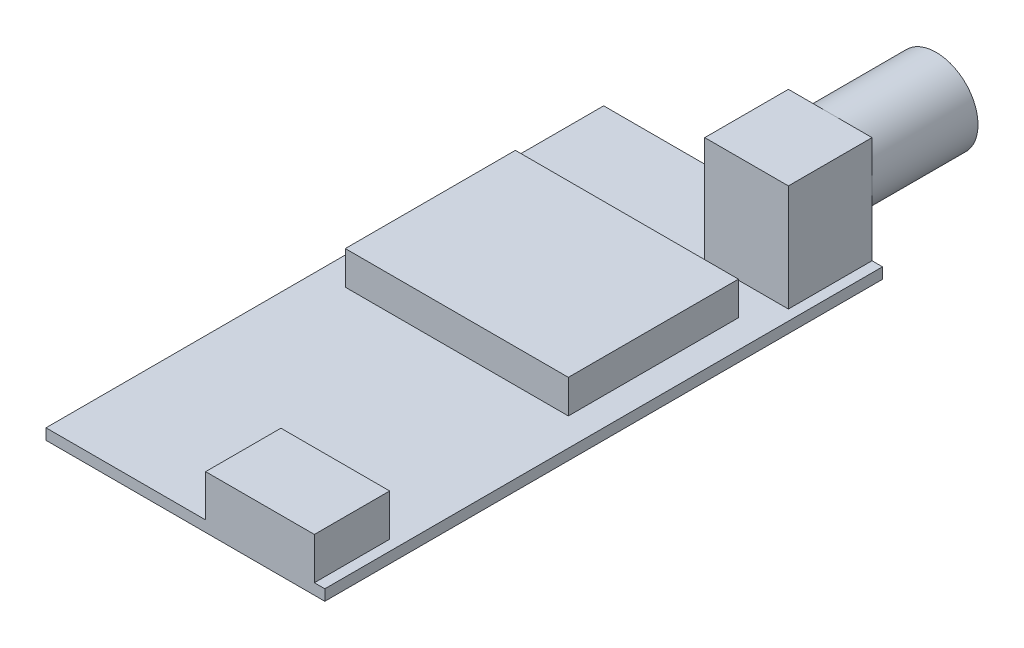
ISO-10303-21;
HEADER;
FILE_DESCRIPTION(('STEP AP214'),'2;1');
FILE_NAME('part.step','',(''),(''),'','','');
FILE_SCHEMA(('AUTOMOTIVE_DESIGN { 1 0 10303 214 1 1 1 1 }'));
ENDSEC;
DATA;
#1=APPLICATION_CONTEXT('core data for automotive mechanical design processes');
#2=APPLICATION_PROTOCOL_DEFINITION('international standard','automotive_design',2000,#1);
#3=PRODUCT_CONTEXT('',#1,'mechanical');
#4=PRODUCT('Part','Part','',(#3));
#5=PRODUCT_RELATED_PRODUCT_CATEGORY('part','',(#4));
#6=PRODUCT_DEFINITION_FORMATION('','',#4);
#7=PRODUCT_DEFINITION_CONTEXT('part definition',#1,'design');
#8=PRODUCT_DEFINITION('design','',#6,#7);
#9=PRODUCT_DEFINITION_SHAPE('','',#8);
#10=(LENGTH_UNIT() NAMED_UNIT(*) SI_UNIT(.MILLI.,.METRE.));
#11=(NAMED_UNIT(*) PLANE_ANGLE_UNIT() SI_UNIT($,.RADIAN.));
#12=(NAMED_UNIT(*) SI_UNIT($,.STERADIAN.) SOLID_ANGLE_UNIT());
#13=UNCERTAINTY_MEASURE_WITH_UNIT(LENGTH_MEASURE(1.E-05),#10,'distance_accuracy_value','');
#14=(GEOMETRIC_REPRESENTATION_CONTEXT(3) GLOBAL_UNCERTAINTY_ASSIGNED_CONTEXT((#13)) GLOBAL_UNIT_ASSIGNED_CONTEXT((#10,
#11,#12)) REPRESENTATION_CONTEXT('',''));
#15=CARTESIAN_POINT('',(0.,0.,0.));
#16=DIRECTION('',(0.,0.,1.));
#17=DIRECTION('',(1.,0.,0.));
#18=AXIS2_PLACEMENT_3D('',#15,#16,#17);
#19=CARTESIAN_POINT('',(0.,0.78,0.));
#20=DIRECTION('',(0.,-1.,0.));
#21=DIRECTION('',(0.,0.,-1.));
#22=AXIS2_PLACEMENT_3D('',#19,#20,#21);
#23=PLANE('',#22);
#24=DIRECTION('',(0.,0.,1.));
#25=VECTOR('',#24,1.);
#26=CARTESIAN_POINT('',(1.45,0.78,40.));
#27=LINE('',#26,#25);
#28=CARTESIAN_POINT('',(1.45,0.78,34.6));
#29=VERTEX_POINT('',#28);
#30=CARTESIAN_POINT('',(1.45,0.78,40.));
#31=VERTEX_POINT('',#30);
#32=EDGE_CURVE('E191',#29,#31,#27,.T.);
#33=ORIENTED_EDGE('',*,*,#32,.F.);
#34=DIRECTION('',(-1.,0.,0.));
#35=VECTOR('',#34,1.);
#36=CARTESIAN_POINT('',(1.45,0.78,34.6));
#37=LINE('',#36,#35);
#38=CARTESIAN_POINT('',(9.25,0.78,34.6));
#39=VERTEX_POINT('',#38);
#40=EDGE_CURVE('E207',#39,#29,#37,.T.);
#41=ORIENTED_EDGE('',*,*,#40,.F.);
#42=DIRECTION('',(0.,0.,-1.));
#43=VECTOR('',#42,1.);
#44=CARTESIAN_POINT('',(9.25,0.78,40.));
#45=LINE('',#44,#43);
#46=CARTESIAN_POINT('',(9.25,0.78,40.));
#47=VERTEX_POINT('',#46);
#48=EDGE_CURVE('E196',#47,#39,#45,.T.);
#49=ORIENTED_EDGE('',*,*,#48,.F.);
#50=DIRECTION('',(1.,0.,0.));
#51=VECTOR('',#50,1.);
#52=CARTESIAN_POINT('',(-10.,0.78,40.));
#53=LINE('',#52,#51);
#54=CARTESIAN_POINT('',(10.,0.78,40.));
#55=VERTEX_POINT('',#54);
#56=EDGE_CURVE('E302',#47,#55,#53,.T.);
#57=ORIENTED_EDGE('',*,*,#56,.T.);
#58=DIRECTION('',(0.,0.,-1.));
#59=VECTOR('',#58,1.);
#60=CARTESIAN_POINT('',(10.,0.78,40.));
#61=LINE('',#60,#59);
#62=CARTESIAN_POINT('',(10.,0.78,0.));
#63=VERTEX_POINT('',#62);
#64=EDGE_CURVE('E289',#55,#63,#61,.T.);
#65=ORIENTED_EDGE('',*,*,#64,.T.);
#66=DIRECTION('',(-1.,0.,0.));
#67=VECTOR('',#66,1.);
#68=CARTESIAN_POINT('',(-10.,0.78,0.));
#69=LINE('',#68,#67);
#70=CARTESIAN_POINT('',(9.25,0.78,0.));
#71=VERTEX_POINT('',#70);
#72=EDGE_CURVE('E295',#63,#71,#69,.T.);
#73=ORIENTED_EDGE('',*,*,#72,.T.);
#74=DIRECTION('',(0.,0.,-1.));
#75=VECTOR('',#74,1.);
#76=CARTESIAN_POINT('',(9.25,0.78,6.));
#77=LINE('',#76,#75);
#78=CARTESIAN_POINT('',(9.25,0.78,6.));
#79=VERTEX_POINT('',#78);
#80=EDGE_CURVE('E260',#79,#71,#77,.T.);
#81=ORIENTED_EDGE('',*,*,#80,.F.);
#82=DIRECTION('',(1.,0.,0.));
#83=VECTOR('',#82,1.);
#84=CARTESIAN_POINT('',(0.,0.78,6.));
#85=LINE('',#84,#83);
#86=CARTESIAN_POINT('',(3.25,0.78,6.));
#87=VERTEX_POINT('',#86);
#88=EDGE_CURVE('E257',#87,#79,#85,.T.);
#89=ORIENTED_EDGE('',*,*,#88,.F.);
#90=DIRECTION('',(0.,0.,-1.));
#91=VECTOR('',#90,1.);
#92=CARTESIAN_POINT('',(3.25,0.78,6.));
#93=LINE('',#92,#91);
#94=CARTESIAN_POINT('',(3.25,0.78,0.));
#95=VERTEX_POINT('',#94);
#96=EDGE_CURVE('E277',#87,#95,#93,.T.);
#97=ORIENTED_EDGE('',*,*,#96,.T.);
#98=CARTESIAN_POINT('',(-10.,0.78,0.));
#99=VERTEX_POINT('',#98);
#100=EDGE_CURVE('E293',#95,#99,#69,.T.);
#101=ORIENTED_EDGE('',*,*,#100,.T.);
#102=DIRECTION('',(0.,0.,1.));
#103=VECTOR('',#102,1.);
#104=CARTESIAN_POINT('',(-10.,0.78,0.));
#105=LINE('',#104,#103);
#106=CARTESIAN_POINT('',(-10.,0.78,40.));
#107=VERTEX_POINT('',#106);
#108=EDGE_CURVE('E299',#99,#107,#105,.T.);
#109=ORIENTED_EDGE('',*,*,#108,.T.);
#110=EDGE_CURVE('E303',#107,#31,#53,.T.);
#111=ORIENTED_EDGE('',*,*,#110,.T.);
#112=EDGE_LOOP('',(#33,#41,#49,#57,#65,#73,#81,#89,#97,#101,#109,#111));
#113=FACE_BOUND('',#112,.T.);
#114=DIRECTION('',(0.,0.,-1.));
#115=VECTOR('',#114,1.);
#116=CARTESIAN_POINT('',(8.,0.78,8.33295447268371));
#117=LINE('',#116,#115);
#118=CARTESIAN_POINT('',(8.00000000000001,0.78,20.5329544726837));
#119=VERTEX_POINT('',#118);
#120=CARTESIAN_POINT('',(8.,0.78,8.33295447268371));
#121=VERTEX_POINT('',#120);
#122=EDGE_CURVE('E189',#119,#121,#117,.T.);
#123=ORIENTED_EDGE('',*,*,#122,.F.);
#124=DIRECTION('',(1.,0.,0.));
#125=VECTOR('',#124,1.);
#126=CARTESIAN_POINT('',(-7.99999999999999,0.78,20.5329544726837));
#127=LINE('',#126,#125);
#128=CARTESIAN_POINT('',(-7.99999999999999,0.78,20.5329544726837));
#129=VERTEX_POINT('',#128);
#130=EDGE_CURVE('E186',#129,#119,#127,.T.);
#131=ORIENTED_EDGE('',*,*,#130,.F.);
#132=DIRECTION('',(0.,0.,1.));
#133=VECTOR('',#132,1.);
#134=CARTESIAN_POINT('',(-8.,0.78,8.33295447268371));
#135=LINE('',#134,#133);
#136=CARTESIAN_POINT('',(-8.,0.78,8.33295447268371));
#137=VERTEX_POINT('',#136);
#138=EDGE_CURVE('E65',#137,#129,#135,.T.);
#139=ORIENTED_EDGE('',*,*,#138,.F.);
#140=DIRECTION('',(-1.,0.,0.));
#141=VECTOR('',#140,1.);
#142=CARTESIAN_POINT('',(-8.,0.78,8.33295447268371));
#143=LINE('',#142,#141);
#144=EDGE_CURVE('E60',#121,#137,#143,.T.);
#145=ORIENTED_EDGE('',*,*,#144,.F.);
#146=EDGE_LOOP('',(#123,#131,#139,#145));
#147=FACE_BOUND('',#146,.T.);
#148=ADVANCED_FACE('F41',(#113,#147),#23,.F.);
#149=CARTESIAN_POINT('',(-10.,0.78,0.));
#150=DIRECTION('',(0.,0.,1.));
#151=DIRECTION('',(1.,0.,0.));
#152=AXIS2_PLACEMENT_3D('',#149,#150,#151);
#153=PLANE('',#152);
#154=DIRECTION('',(0.,-1.,0.));
#155=VECTOR('',#154,1.);
#156=CARTESIAN_POINT('',(9.25,0.,0.));
#157=LINE('',#156,#155);
#158=CARTESIAN_POINT('',(9.25,8.43,0.));
#159=VERTEX_POINT('',#158);
#160=CARTESIAN_POINT('',(9.25,5.43,0.));
#161=VERTEX_POINT('',#160);
#162=EDGE_CURVE('E261',#159,#161,#157,.T.);
#163=ORIENTED_EDGE('',*,*,#162,.T.);
#164=CARTESIAN_POINT('',(6.25,5.43,0.));
#165=DIRECTION('',(0.,0.,1.));
#166=DIRECTION('',(1.,0.,0.));
#167=AXIS2_PLACEMENT_3D('',#164,#165,#166);
#168=CIRCLE('',#167,3.);
#169=CARTESIAN_POINT('',(6.25,8.43,0.));
#170=VERTEX_POINT('',#169);
#171=EDGE_CURVE('E53',#161,#170,#168,.T.);
#172=ORIENTED_EDGE('',*,*,#171,.T.);
#173=DIRECTION('',(1.,0.,0.));
#174=VECTOR('',#173,1.);
#175=CARTESIAN_POINT('',(0.,8.43,0.));
#176=LINE('',#175,#174);
#177=EDGE_CURVE('E265',#170,#159,#176,.T.);
#178=ORIENTED_EDGE('',*,*,#177,.T.);
#179=EDGE_LOOP('',(#163,#172,#178));
#180=FACE_BOUND('',#179,.T.);
#181=ADVANCED_FACE('F348',(#180),#153,.F.);
#182=CARTESIAN_POINT('',(3.25,8.43,0.));
#183=VERTEX_POINT('',#182);
#184=EDGE_CURVE('E266',#183,#170,#176,.T.);
#185=ORIENTED_EDGE('',*,*,#184,.T.);
#186=CARTESIAN_POINT('',(3.25,5.43,0.));
#187=VERTEX_POINT('',#186);
#188=EDGE_CURVE('E11',#170,#187,#168,.T.);
#189=ORIENTED_EDGE('',*,*,#188,.T.);
#190=DIRECTION('',(0.,-1.,0.));
#191=VECTOR('',#190,1.);
#192=CARTESIAN_POINT('',(3.25,0.,0.));
#193=LINE('',#192,#191);
#194=EDGE_CURVE('E250',#183,#187,#193,.T.);
#195=ORIENTED_EDGE('',*,*,#194,.F.);
#196=EDGE_LOOP('',(#185,#189,#195));
#197=FACE_BOUND('',#196,.T.);
#198=ADVANCED_FACE('F379',(#197),#153,.F.);
#199=CARTESIAN_POINT('',(10.,0.78,40.));
#200=DIRECTION('',(-1.,0.,0.));
#201=DIRECTION('',(0.,0.,1.));
#202=AXIS2_PLACEMENT_3D('',#199,#200,#201);
#203=PLANE('',#202);
#204=DIRECTION('',(0.,0.,-1.));
#205=VECTOR('',#204,1.);
#206=CARTESIAN_POINT('',(10.,0.,40.));
#207=LINE('',#206,#205);
#208=CARTESIAN_POINT('',(10.,0.,40.));
#209=VERTEX_POINT('',#208);
#210=CARTESIAN_POINT('',(10.,0.,0.));
#211=VERTEX_POINT('',#210);
#212=EDGE_CURVE('E288',#209,#211,#207,.T.);
#213=ORIENTED_EDGE('',*,*,#212,.T.);
#214=DIRECTION('',(0.,-1.,0.));
#215=VECTOR('',#214,1.);
#216=CARTESIAN_POINT('',(10.,0.78,0.));
#217=LINE('',#216,#215);
#218=EDGE_CURVE('E45',#63,#211,#217,.T.);
#219=ORIENTED_EDGE('',*,*,#218,.F.);
#220=ORIENTED_EDGE('',*,*,#64,.F.);
#221=DIRECTION('',(0.,-1.,0.));
#222=VECTOR('',#221,1.);
#223=CARTESIAN_POINT('',(10.,0.78,40.));
#224=LINE('',#223,#222);
#225=EDGE_CURVE('E306',#55,#209,#224,.T.);
#226=ORIENTED_EDGE('',*,*,#225,.T.);
#227=EDGE_LOOP('',(#213,#219,#220,#226));
#228=FACE_BOUND('',#227,.T.);
#229=ADVANCED_FACE('F43',(#228),#203,.F.);
#230=EDGE_CURVE('E270',#187,#95,#193,.T.);
#231=ORIENTED_EDGE('',*,*,#230,.F.);
#232=EDGE_CURVE('E51',#187,#161,#168,.T.);
#233=ORIENTED_EDGE('',*,*,#232,.T.);
#234=EDGE_CURVE('E241',#161,#71,#157,.T.);
#235=ORIENTED_EDGE('',*,*,#234,.T.);
#236=ORIENTED_EDGE('',*,*,#72,.F.);
#237=ORIENTED_EDGE('',*,*,#218,.T.);
#238=DIRECTION('',(-1.,0.,0.));
#239=VECTOR('',#238,1.);
#240=CARTESIAN_POINT('',(-10.,0.,0.));
#241=LINE('',#240,#239);
#242=CARTESIAN_POINT('',(-10.,0.,0.));
#243=VERTEX_POINT('',#242);
#244=EDGE_CURVE('E310',#211,#243,#241,.T.);
#245=ORIENTED_EDGE('',*,*,#244,.T.);
#246=DIRECTION('',(0.,-1.,0.));
#247=VECTOR('',#246,1.);
#248=CARTESIAN_POINT('',(-10.,0.78,0.));
#249=LINE('',#248,#247);
#250=EDGE_CURVE('E324',#99,#243,#249,.T.);
#251=ORIENTED_EDGE('',*,*,#250,.F.);
#252=ORIENTED_EDGE('',*,*,#100,.F.);
#253=EDGE_LOOP('',(#231,#233,#235,#236,#237,#245,#251,#252));
#254=FACE_BOUND('',#253,.T.);
#255=ADVANCED_FACE('F339',(#254),#153,.F.);
#256=CARTESIAN_POINT('',(-10.,0.78,0.));
#257=DIRECTION('',(1.,0.,0.));
#258=DIRECTION('',(0.,0.,-1.));
#259=AXIS2_PLACEMENT_3D('',#256,#257,#258);
#260=PLANE('',#259);
#261=DIRECTION('',(0.,0.,1.));
#262=VECTOR('',#261,1.);
#263=CARTESIAN_POINT('',(-10.,0.,0.));
#264=LINE('',#263,#262);
#265=CARTESIAN_POINT('',(-10.,0.,40.));
#266=VERTEX_POINT('',#265);
#267=EDGE_CURVE('E313',#243,#266,#264,.T.);
#268=ORIENTED_EDGE('',*,*,#267,.T.);
#269=DIRECTION('',(0.,-1.,0.));
#270=VECTOR('',#269,1.);
#271=CARTESIAN_POINT('',(-10.,0.78,40.));
#272=LINE('',#271,#270);
#273=EDGE_CURVE('E321',#107,#266,#272,.T.);
#274=ORIENTED_EDGE('',*,*,#273,.F.);
#275=ORIENTED_EDGE('',*,*,#108,.F.);
#276=ORIENTED_EDGE('',*,*,#250,.T.);
#277=EDGE_LOOP('',(#268,#274,#275,#276));
#278=FACE_BOUND('',#277,.T.);
#279=ADVANCED_FACE('F371',(#278),#260,.F.);
#280=CARTESIAN_POINT('',(-10.,0.78,40.));
#281=DIRECTION('',(0.,0.,-1.));
#282=DIRECTION('',(-1.,0.,0.));
#283=AXIS2_PLACEMENT_3D('',#280,#281,#282);
#284=PLANE('',#283);
#285=DIRECTION('',(1.,0.,0.));
#286=VECTOR('',#285,1.);
#287=CARTESIAN_POINT('',(-10.,0.,40.));
#288=LINE('',#287,#286);
#289=EDGE_CURVE('E294',#266,#209,#288,.T.);
#290=ORIENTED_EDGE('',*,*,#289,.T.);
#291=ORIENTED_EDGE('',*,*,#225,.F.);
#292=ORIENTED_EDGE('',*,*,#56,.F.);
#293=DIRECTION('',(0.,-1.,0.));
#294=VECTOR('',#293,1.);
#295=CARTESIAN_POINT('',(9.25,3.78,40.));
#296=LINE('',#295,#294);
#297=CARTESIAN_POINT('',(9.25,3.78,40.));
#298=VERTEX_POINT('',#297);
#299=EDGE_CURVE('E230',#298,#47,#296,.T.);
#300=ORIENTED_EDGE('',*,*,#299,.F.);
#301=DIRECTION('',(1.,0.,0.));
#302=VECTOR('',#301,1.);
#303=CARTESIAN_POINT('',(1.45,3.78,40.));
#304=LINE('',#303,#302);
#305=CARTESIAN_POINT('',(1.45,3.78,40.));
#306=VERTEX_POINT('',#305);
#307=EDGE_CURVE('E206',#306,#298,#304,.T.);
#308=ORIENTED_EDGE('',*,*,#307,.F.);
#309=DIRECTION('',(0.,-1.,0.));
#310=VECTOR('',#309,1.);
#311=CARTESIAN_POINT('',(1.45,3.78,40.));
#312=LINE('',#311,#310);
#313=EDGE_CURVE('E234',#306,#31,#312,.T.);
#314=ORIENTED_EDGE('',*,*,#313,.T.);
#315=ORIENTED_EDGE('',*,*,#110,.F.);
#316=ORIENTED_EDGE('',*,*,#273,.T.);
#317=EDGE_LOOP('',(#290,#291,#292,#300,#308,#314,#315,#316));
#318=FACE_BOUND('',#317,.T.);
#319=ADVANCED_FACE('F403',(#318),#284,.F.);
#320=CARTESIAN_POINT('',(0.,0.,0.));
#321=DIRECTION('',(0.,-1.,0.));
#322=DIRECTION('',(0.,0.,-1.));
#323=AXIS2_PLACEMENT_3D('',#320,#321,#322);
#324=PLANE('',#323);
#325=ORIENTED_EDGE('',*,*,#212,.F.);
#326=ORIENTED_EDGE('',*,*,#289,.F.);
#327=ORIENTED_EDGE('',*,*,#267,.F.);
#328=ORIENTED_EDGE('',*,*,#244,.F.);
#329=EDGE_LOOP('',(#325,#326,#327,#328));
#330=FACE_BOUND('',#329,.T.);
#331=ADVANCED_FACE('F369',(#330),#324,.T.);
#332=CARTESIAN_POINT('',(9.25,0.,6.));
#333=DIRECTION('',(1.,0.,0.));
#334=DIRECTION('',(0.,0.,-1.));
#335=AXIS2_PLACEMENT_3D('',#332,#333,#334);
#336=PLANE('',#335);
#337=ORIENTED_EDGE('',*,*,#162,.F.);
#338=DIRECTION('',(0.,0.,-1.));
#339=VECTOR('',#338,1.);
#340=CARTESIAN_POINT('',(9.25,8.43,6.));
#341=LINE('',#340,#339);
#342=CARTESIAN_POINT('',(9.25,8.43,6.));
#343=VERTEX_POINT('',#342);
#344=EDGE_CURVE('E284',#343,#159,#341,.T.);
#345=ORIENTED_EDGE('',*,*,#344,.F.);
#346=DIRECTION('',(0.,-1.,0.));
#347=VECTOR('',#346,1.);
#348=CARTESIAN_POINT('',(9.25,0.,6.));
#349=LINE('',#348,#347);
#350=EDGE_CURVE('E245',#343,#79,#349,.T.);
#351=ORIENTED_EDGE('',*,*,#350,.T.);
#352=ORIENTED_EDGE('',*,*,#80,.T.);
#353=ORIENTED_EDGE('',*,*,#234,.F.);
#354=EDGE_LOOP('',(#337,#345,#351,#352,#353));
#355=FACE_BOUND('',#354,.T.);
#356=ADVANCED_FACE('F344',(#355),#336,.T.);
#357=CARTESIAN_POINT('',(0.,8.43,6.));
#358=DIRECTION('',(0.,1.,0.));
#359=DIRECTION('',(-1.,0.,0.));
#360=AXIS2_PLACEMENT_3D('',#357,#358,#359);
#361=PLANE('',#360);
#362=ORIENTED_EDGE('',*,*,#184,.F.);
#363=DIRECTION('',(0.,0.,-1.));
#364=VECTOR('',#363,1.);
#365=CARTESIAN_POINT('',(3.25,8.43,6.));
#366=LINE('',#365,#364);
#367=CARTESIAN_POINT('',(3.25,8.43,6.));
#368=VERTEX_POINT('',#367);
#369=EDGE_CURVE('E281',#368,#183,#366,.T.);
#370=ORIENTED_EDGE('',*,*,#369,.F.);
#371=DIRECTION('',(1.,0.,0.));
#372=VECTOR('',#371,1.);
#373=CARTESIAN_POINT('',(0.,8.43,6.));
#374=LINE('',#373,#372);
#375=EDGE_CURVE('E249',#368,#343,#374,.T.);
#376=ORIENTED_EDGE('',*,*,#375,.T.);
#377=ORIENTED_EDGE('',*,*,#344,.T.);
#378=ORIENTED_EDGE('',*,*,#177,.F.);
#379=EDGE_LOOP('',(#362,#370,#376,#377,#378));
#380=FACE_BOUND('',#379,.T.);
#381=ADVANCED_FACE('F353',(#380),#361,.T.);
#382=CARTESIAN_POINT('',(3.25,0.,6.));
#383=DIRECTION('',(1.,0.,0.));
#384=DIRECTION('',(0.,1.,0.));
#385=AXIS2_PLACEMENT_3D('',#382,#383,#384);
#386=PLANE('',#385);
#387=ORIENTED_EDGE('',*,*,#194,.T.);
#388=ORIENTED_EDGE('',*,*,#230,.T.);
#389=ORIENTED_EDGE('',*,*,#96,.F.);
#390=DIRECTION('',(0.,-1.,0.));
#391=VECTOR('',#390,1.);
#392=CARTESIAN_POINT('',(3.25,0.,6.));
#393=LINE('',#392,#391);
#394=EDGE_CURVE('E254',#368,#87,#393,.T.);
#395=ORIENTED_EDGE('',*,*,#394,.F.);
#396=ORIENTED_EDGE('',*,*,#369,.T.);
#397=EDGE_LOOP('',(#387,#388,#389,#395,#396));
#398=FACE_BOUND('',#397,.T.);
#399=ADVANCED_FACE('F376',(#398),#386,.F.);
#400=CARTESIAN_POINT('',(0.,0.,6.));
#401=DIRECTION('',(0.,0.,1.));
#402=DIRECTION('',(1.,0.,0.));
#403=AXIS2_PLACEMENT_3D('',#400,#401,#402);
#404=PLANE('',#403);
#405=ORIENTED_EDGE('',*,*,#350,.F.);
#406=ORIENTED_EDGE('',*,*,#375,.F.);
#407=ORIENTED_EDGE('',*,*,#394,.T.);
#408=ORIENTED_EDGE('',*,*,#88,.T.);
#409=EDGE_LOOP('',(#405,#406,#407,#408));
#410=FACE_BOUND('',#409,.T.);
#411=ADVANCED_FACE('F357',(#410),#404,.T.);
#412=CARTESIAN_POINT('',(6.25,5.43,-7.6));
#413=DIRECTION('',(0.,0.,1.));
#414=DIRECTION('',(1.,0.,0.));
#415=AXIS2_PLACEMENT_3D('',#412,#413,#414);
#416=CYLINDRICAL_SURFACE('',#415,3.);
#417=CARTESIAN_POINT('',(6.25,5.43,-7.6));
#418=DIRECTION('',(0.,0.,1.));
#419=DIRECTION('',(1.,0.,0.));
#420=AXIS2_PLACEMENT_3D('',#417,#418,#419);
#421=CIRCLE('',#420,3.);
#422=CARTESIAN_POINT('',(9.25,5.43,-7.6));
#423=VERTEX_POINT('',#422);
#424=EDGE_CURVE('E238',#423,#423,#421,.T.);
#425=ORIENTED_EDGE('',*,*,#424,.T.);
#426=EDGE_LOOP('',(#425));
#427=FACE_BOUND('',#426,.T.);
#428=ORIENTED_EDGE('',*,*,#171,.F.);
#429=ORIENTED_EDGE('',*,*,#232,.F.);
#430=ORIENTED_EDGE('',*,*,#188,.F.);
#431=EDGE_LOOP('',(#428,#429,#430));
#432=FACE_BOUND('',#431,.T.);
#433=ADVANCED_FACE('F380',(#427,#432),#416,.T.);
#434=CARTESIAN_POINT('',(0.,0.,-7.6));
#435=DIRECTION('',(0.,0.,1.));
#436=DIRECTION('',(1.,0.,0.));
#437=AXIS2_PLACEMENT_3D('',#434,#435,#436);
#438=PLANE('',#437);
#439=ORIENTED_EDGE('',*,*,#424,.F.);
#440=EDGE_LOOP('',(#439));
#441=FACE_BOUND('',#440,.T.);
#442=ADVANCED_FACE('F382',(#441),#438,.F.);
#443=CARTESIAN_POINT('',(1.45,3.78,40.));
#444=DIRECTION('',(1.,0.,0.));
#445=DIRECTION('',(0.,0.,-1.));
#446=AXIS2_PLACEMENT_3D('',#443,#444,#445);
#447=PLANE('',#446);
#448=ORIENTED_EDGE('',*,*,#32,.T.);
#449=ORIENTED_EDGE('',*,*,#313,.F.);
#450=DIRECTION('',(0.,0.,1.));
#451=VECTOR('',#450,1.);
#452=CARTESIAN_POINT('',(1.45,3.78,40.));
#453=LINE('',#452,#451);
#454=CARTESIAN_POINT('',(1.45,3.78,34.6));
#455=VERTEX_POINT('',#454);
#456=EDGE_CURVE('E202',#455,#306,#453,.T.);
#457=ORIENTED_EDGE('',*,*,#456,.F.);
#458=DIRECTION('',(0.,-1.,0.));
#459=VECTOR('',#458,1.);
#460=CARTESIAN_POINT('',(1.45,3.78,34.6));
#461=LINE('',#460,#459);
#462=EDGE_CURVE('E215',#455,#29,#461,.T.);
#463=ORIENTED_EDGE('',*,*,#462,.T.);
#464=EDGE_LOOP('',(#448,#449,#457,#463));
#465=FACE_BOUND('',#464,.T.);
#466=ADVANCED_FACE('F389',(#465),#447,.F.);
#467=CARTESIAN_POINT('',(9.25,3.78,40.));
#468=DIRECTION('',(-1.,0.,0.));
#469=DIRECTION('',(0.,0.,1.));
#470=AXIS2_PLACEMENT_3D('',#467,#468,#469);
#471=PLANE('',#470);
#472=ORIENTED_EDGE('',*,*,#48,.T.);
#473=DIRECTION('',(0.,-1.,0.));
#474=VECTOR('',#473,1.);
#475=CARTESIAN_POINT('',(9.25,3.78,34.6));
#476=LINE('',#475,#474);
#477=CARTESIAN_POINT('',(9.25,3.78,34.6));
#478=VERTEX_POINT('',#477);
#479=EDGE_CURVE('E226',#478,#39,#476,.T.);
#480=ORIENTED_EDGE('',*,*,#479,.F.);
#481=DIRECTION('',(0.,0.,-1.));
#482=VECTOR('',#481,1.);
#483=CARTESIAN_POINT('',(9.25,3.78,40.));
#484=LINE('',#483,#482);
#485=EDGE_CURVE('E210',#298,#478,#484,.T.);
#486=ORIENTED_EDGE('',*,*,#485,.F.);
#487=ORIENTED_EDGE('',*,*,#299,.T.);
#488=EDGE_LOOP('',(#472,#480,#486,#487));
#489=FACE_BOUND('',#488,.T.);
#490=ADVANCED_FACE('F481',(#489),#471,.F.);
#491=CARTESIAN_POINT('',(1.45,3.78,34.6));
#492=DIRECTION('',(0.,0.,1.));
#493=DIRECTION('',(1.,0.,0.));
#494=AXIS2_PLACEMENT_3D('',#491,#492,#493);
#495=PLANE('',#494);
#496=ORIENTED_EDGE('',*,*,#40,.T.);
#497=ORIENTED_EDGE('',*,*,#462,.F.);
#498=DIRECTION('',(-1.,0.,0.));
#499=VECTOR('',#498,1.);
#500=CARTESIAN_POINT('',(1.45,3.78,34.6));
#501=LINE('',#500,#499);
#502=EDGE_CURVE('E213',#478,#455,#501,.T.);
#503=ORIENTED_EDGE('',*,*,#502,.F.);
#504=ORIENTED_EDGE('',*,*,#479,.T.);
#505=EDGE_LOOP('',(#496,#497,#503,#504));
#506=FACE_BOUND('',#505,.T.);
#507=ADVANCED_FACE('F490',(#506),#495,.F.);
#508=CARTESIAN_POINT('',(0.,3.78,0.));
#509=DIRECTION('',(0.,-1.,0.));
#510=DIRECTION('',(0.,0.,-1.));
#511=AXIS2_PLACEMENT_3D('',#508,#509,#510);
#512=PLANE('',#511);
#513=ORIENTED_EDGE('',*,*,#456,.T.);
#514=ORIENTED_EDGE('',*,*,#307,.T.);
#515=ORIENTED_EDGE('',*,*,#485,.T.);
#516=ORIENTED_EDGE('',*,*,#502,.T.);
#517=EDGE_LOOP('',(#513,#514,#515,#516));
#518=FACE_BOUND('',#517,.T.);
#519=ADVANCED_FACE('F499',(#518),#512,.F.);
#520=CARTESIAN_POINT('',(8.,3.18,8.33295447268371));
#521=DIRECTION('',(-1.,0.,0.));
#522=DIRECTION('',(0.,0.,1.));
#523=AXIS2_PLACEMENT_3D('',#520,#521,#522);
#524=PLANE('',#523);
#525=ORIENTED_EDGE('',*,*,#122,.T.);
#526=DIRECTION('',(0.,-1.,0.));
#527=VECTOR('',#526,1.);
#528=CARTESIAN_POINT('',(8.,3.18,8.33295447268371));
#529=LINE('',#528,#527);
#530=CARTESIAN_POINT('',(8.,3.18,8.33295447268371));
#531=VERTEX_POINT('',#530);
#532=EDGE_CURVE('E168',#531,#121,#529,.T.);
#533=ORIENTED_EDGE('',*,*,#532,.F.);
#534=DIRECTION('',(0.,0.,-1.));
#535=VECTOR('',#534,1.);
#536=CARTESIAN_POINT('',(8.,3.18,8.33295447268371));
#537=LINE('',#536,#535);
#538=CARTESIAN_POINT('',(8.00000000000001,3.18,20.5329544726837));
#539=VERTEX_POINT('',#538);
#540=EDGE_CURVE('E176',#539,#531,#537,.T.);
#541=ORIENTED_EDGE('',*,*,#540,.F.);
#542=DIRECTION('',(0.,-1.,0.));
#543=VECTOR('',#542,1.);
#544=CARTESIAN_POINT('',(8.00000000000001,3.18,20.5329544726837));
#545=LINE('',#544,#543);
#546=EDGE_CURVE('E565',#539,#119,#545,.T.);
#547=ORIENTED_EDGE('',*,*,#546,.T.);
#548=EDGE_LOOP('',(#525,#533,#541,#547));
#549=FACE_BOUND('',#548,.T.);
#550=ADVANCED_FACE('F188',(#549),#524,.F.);
#551=CARTESIAN_POINT('',(-8.,3.18,8.33295447268371));
#552=DIRECTION('',(0.,0.,1.));
#553=DIRECTION('',(1.,0.,0.));
#554=AXIS2_PLACEMENT_3D('',#551,#552,#553);
#555=PLANE('',#554);
#556=ORIENTED_EDGE('',*,*,#144,.T.);
#557=DIRECTION('',(0.,-1.,0.));
#558=VECTOR('',#557,1.);
#559=CARTESIAN_POINT('',(-8.,3.18,8.33295447268371));
#560=LINE('',#559,#558);
#561=CARTESIAN_POINT('',(-8.,3.18,8.33295447268371));
#562=VERTEX_POINT('',#561);
#563=EDGE_CURVE('E171',#562,#137,#560,.T.);
#564=ORIENTED_EDGE('',*,*,#563,.F.);
#565=DIRECTION('',(-1.,0.,0.));
#566=VECTOR('',#565,1.);
#567=CARTESIAN_POINT('',(-8.,3.18,8.33295447268371));
#568=LINE('',#567,#566);
#569=EDGE_CURVE('E164',#531,#562,#568,.T.);
#570=ORIENTED_EDGE('',*,*,#569,.F.);
#571=ORIENTED_EDGE('',*,*,#532,.T.);
#572=EDGE_LOOP('',(#556,#564,#570,#571));
#573=FACE_BOUND('',#572,.T.);
#574=ADVANCED_FACE('F166',(#573),#555,.F.);
#575=CARTESIAN_POINT('',(-8.,3.18,8.33295447268371));
#576=DIRECTION('',(1.,0.,0.));
#577=DIRECTION('',(0.,0.,-1.));
#578=AXIS2_PLACEMENT_3D('',#575,#576,#577);
#579=PLANE('',#578);
#580=ORIENTED_EDGE('',*,*,#138,.T.);
#581=DIRECTION('',(0.,-1.,0.));
#582=VECTOR('',#581,1.);
#583=CARTESIAN_POINT('',(-7.99999999999999,3.18,20.5329544726837));
#584=LINE('',#583,#582);
#585=CARTESIAN_POINT('',(-7.99999999999999,3.18,20.5329544726837));
#586=VERTEX_POINT('',#585);
#587=EDGE_CURVE('E198',#586,#129,#584,.T.);
#588=ORIENTED_EDGE('',*,*,#587,.F.);
#589=DIRECTION('',(0.,0.,1.));
#590=VECTOR('',#589,1.);
#591=CARTESIAN_POINT('',(-8.,3.18,8.33295447268371));
#592=LINE('',#591,#590);
#593=EDGE_CURVE('E175',#562,#586,#592,.T.);
#594=ORIENTED_EDGE('',*,*,#593,.F.);
#595=ORIENTED_EDGE('',*,*,#563,.T.);
#596=EDGE_LOOP('',(#580,#588,#594,#595));
#597=FACE_BOUND('',#596,.T.);
#598=ADVANCED_FACE('F527',(#597),#579,.F.);
#599=CARTESIAN_POINT('',(-7.99999999999999,3.18,20.5329544726837));
#600=DIRECTION('',(0.,0.,-1.));
#601=DIRECTION('',(-1.,0.,0.));
#602=AXIS2_PLACEMENT_3D('',#599,#600,#601);
#603=PLANE('',#602);
#604=ORIENTED_EDGE('',*,*,#130,.T.);
#605=ORIENTED_EDGE('',*,*,#546,.F.);
#606=DIRECTION('',(1.,0.,0.));
#607=VECTOR('',#606,1.);
#608=CARTESIAN_POINT('',(-7.99999999999999,3.18,20.5329544726837));
#609=LINE('',#608,#607);
#610=EDGE_CURVE('E181',#586,#539,#609,.T.);
#611=ORIENTED_EDGE('',*,*,#610,.F.);
#612=ORIENTED_EDGE('',*,*,#587,.T.);
#613=EDGE_LOOP('',(#604,#605,#611,#612));
#614=FACE_BOUND('',#613,.T.);
#615=ADVANCED_FACE('F535',(#614),#603,.F.);
#616=CARTESIAN_POINT('',(0.,3.18,0.));
#617=DIRECTION('',(0.,1.,0.));
#618=DIRECTION('',(0.,0.,1.));
#619=AXIS2_PLACEMENT_3D('',#616,#617,#618);
#620=PLANE('',#619);
#621=ORIENTED_EDGE('',*,*,#540,.T.);
#622=ORIENTED_EDGE('',*,*,#569,.T.);
#623=ORIENTED_EDGE('',*,*,#593,.T.);
#624=ORIENTED_EDGE('',*,*,#610,.T.);
#625=EDGE_LOOP('',(#621,#622,#623,#624));
#626=FACE_BOUND('',#625,.T.);
#627=ADVANCED_FACE('F179',(#626),#620,.T.);
#628=CLOSED_SHELL('',(#148,#181,#198,#229,#255,#279,#319,#331,#356,#381,#399,#411,#433,#442,
#466,#490,#507,#519,#550,#574,#598,#615,#627));
#629=MANIFOLD_SOLID_BREP('B2',#628);
#630=ADVANCED_BREP_SHAPE_REPRESENTATION('',(#18,#629),#14);
#631=SHAPE_DEFINITION_REPRESENTATION(#9,#630);
ENDSEC;
END-ISO-10303-21;
